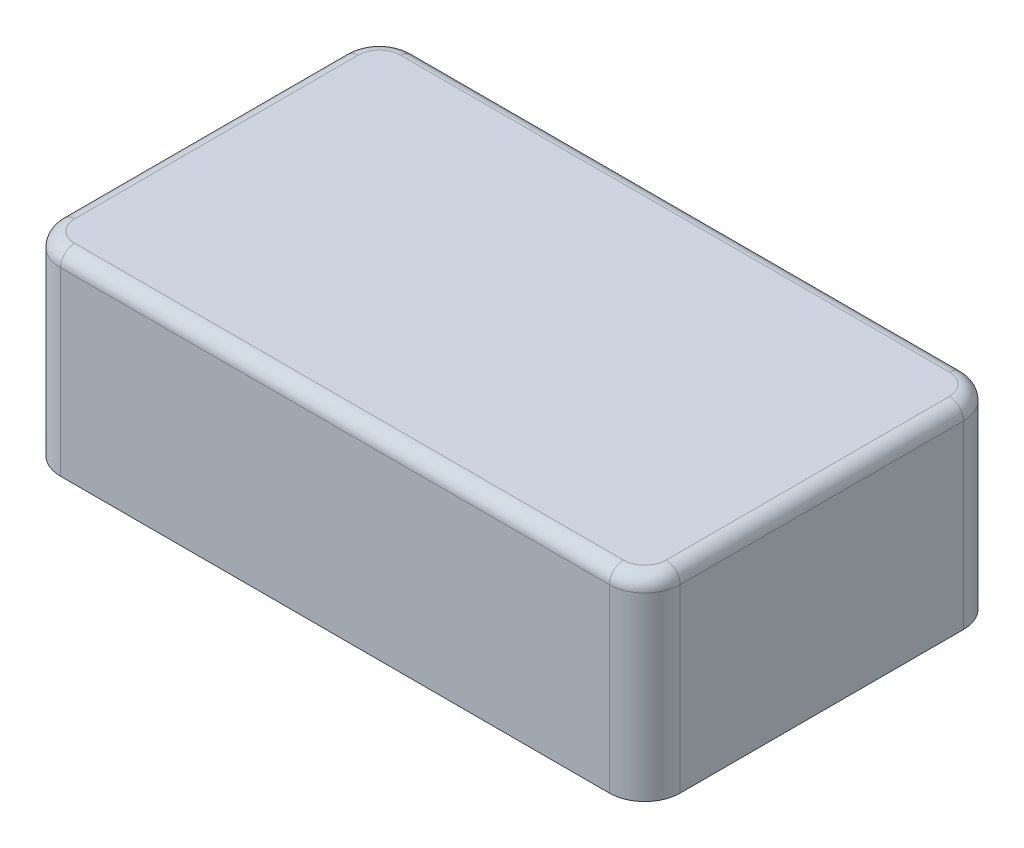
ISO-10303-21;
HEADER;
FILE_DESCRIPTION(('STEP AP214'),'2;1');
FILE_NAME('part.step','',(''),(''),'','','');
FILE_SCHEMA(('AUTOMOTIVE_DESIGN { 1 0 10303 214 1 1 1 1 }'));
ENDSEC;
DATA;
#1=APPLICATION_CONTEXT('core data for automotive mechanical design processes');
#2=APPLICATION_PROTOCOL_DEFINITION('international standard','automotive_design',2000,#1);
#3=PRODUCT_CONTEXT('',#1,'mechanical');
#4=PRODUCT('Part','Part','',(#3));
#5=PRODUCT_RELATED_PRODUCT_CATEGORY('part','',(#4));
#6=PRODUCT_DEFINITION_FORMATION('','',#4);
#7=PRODUCT_DEFINITION_CONTEXT('part definition',#1,'design');
#8=PRODUCT_DEFINITION('design','',#6,#7);
#9=PRODUCT_DEFINITION_SHAPE('','',#8);
#10=(LENGTH_UNIT() NAMED_UNIT(*) SI_UNIT(.MILLI.,.METRE.));
#11=(NAMED_UNIT(*) PLANE_ANGLE_UNIT() SI_UNIT($,.RADIAN.));
#12=(NAMED_UNIT(*) SI_UNIT($,.STERADIAN.) SOLID_ANGLE_UNIT());
#13=UNCERTAINTY_MEASURE_WITH_UNIT(LENGTH_MEASURE(1.E-05),#10,'distance_accuracy_value','');
#14=(GEOMETRIC_REPRESENTATION_CONTEXT(3) GLOBAL_UNCERTAINTY_ASSIGNED_CONTEXT((#13)) GLOBAL_UNIT_ASSIGNED_CONTEXT((#10,
#11,#12)) REPRESENTATION_CONTEXT('',''));
#15=CARTESIAN_POINT('',(0.,0.,0.));
#16=DIRECTION('',(0.,0.,1.));
#17=DIRECTION('',(1.,0.,0.));
#18=AXIS2_PLACEMENT_3D('',#15,#16,#17);
#19=CARTESIAN_POINT('',(1.55,1.1,-0.800000000000001));
#20=DIRECTION('',(0.,-1.,0.));
#21=DIRECTION('',(0.,0.,-1.));
#22=AXIS2_PLACEMENT_3D('',#19,#20,#21);
#23=CYLINDRICAL_SURFACE('',#22,0.2);
#24=DIRECTION('',(0.,-1.,0.));
#25=VECTOR('',#24,1.);
#26=CARTESIAN_POINT('',(1.55,1.1,-1.));
#27=LINE('',#26,#25);
#28=CARTESIAN_POINT('',(1.55,1.02,-1.));
#29=VERTEX_POINT('',#28);
#30=CARTESIAN_POINT('',(1.55,0.,-1.));
#31=VERTEX_POINT('',#30);
#32=EDGE_CURVE('E120',#29,#31,#27,.T.);
#33=ORIENTED_EDGE('',*,*,#32,.F.);
#34=CARTESIAN_POINT('',(1.55,1.02,-0.800000000000001));
#35=DIRECTION('',(0.,1.,0.));
#36=DIRECTION('',(0.,0.,1.));
#37=AXIS2_PLACEMENT_3D('',#34,#35,#36);
#38=CIRCLE('',#37,0.2);
#39=CARTESIAN_POINT('',(1.75,1.02,-0.800000000000001));
#40=VERTEX_POINT('',#39);
#41=EDGE_CURVE('E11',#29,#40,#38,.F.);
#42=ORIENTED_EDGE('',*,*,#41,.T.);
#43=DIRECTION('',(0.,-1.,0.));
#44=VECTOR('',#43,1.);
#45=CARTESIAN_POINT('',(1.75,1.1,-0.800000000000001));
#46=LINE('',#45,#44);
#47=CARTESIAN_POINT('',(1.75,0.,-0.800000000000001));
#48=VERTEX_POINT('',#47);
#49=EDGE_CURVE('E141',#40,#48,#46,.T.);
#50=ORIENTED_EDGE('',*,*,#49,.T.);
#51=CARTESIAN_POINT('',(1.55,0.,-0.800000000000001));
#52=DIRECTION('',(0.,1.,0.));
#53=DIRECTION('',(0.,0.,1.));
#54=AXIS2_PLACEMENT_3D('',#51,#52,#53);
#55=CIRCLE('',#54,0.2);
#56=EDGE_CURVE('E135',#48,#31,#55,.T.);
#57=ORIENTED_EDGE('',*,*,#56,.T.);
#58=EDGE_LOOP('',(#33,#42,#50,#57));
#59=FACE_BOUND('',#58,.T.);
#60=ADVANCED_FACE('F32',(#59),#23,.T.);
#61=CARTESIAN_POINT('',(1.55,1.1,-1.));
#62=DIRECTION('',(0.,0.,1.));
#63=DIRECTION('',(1.,0.,0.));
#64=AXIS2_PLACEMENT_3D('',#61,#62,#63);
#65=PLANE('',#64);
#66=DIRECTION('',(0.,-1.,0.));
#67=VECTOR('',#66,1.);
#68=CARTESIAN_POINT('',(-1.55,1.1,-1.));
#69=LINE('',#68,#67);
#70=CARTESIAN_POINT('',(-1.55,1.02,-1.));
#71=VERTEX_POINT('',#70);
#72=CARTESIAN_POINT('',(-1.55,0.,-1.));
#73=VERTEX_POINT('',#72);
#74=EDGE_CURVE('E129',#71,#73,#69,.T.);
#75=ORIENTED_EDGE('',*,*,#74,.F.);
#76=DIRECTION('',(-1.,0.,0.));
#77=VECTOR('',#76,1.);
#78=CARTESIAN_POINT('',(1.55,1.02,-1.));
#79=LINE('',#78,#77);
#80=EDGE_CURVE('E41',#71,#29,#79,.F.);
#81=ORIENTED_EDGE('',*,*,#80,.T.);
#82=ORIENTED_EDGE('',*,*,#32,.T.);
#83=DIRECTION('',(-1.,0.,0.));
#84=VECTOR('',#83,1.);
#85=CARTESIAN_POINT('',(1.55,0.,-1.));
#86=LINE('',#85,#84);
#87=EDGE_CURVE('E123',#31,#73,#86,.T.);
#88=ORIENTED_EDGE('',*,*,#87,.T.);
#89=EDGE_LOOP('',(#75,#81,#82,#88));
#90=FACE_BOUND('',#89,.T.);
#91=ADVANCED_FACE('F122',(#90),#65,.F.);
#92=CARTESIAN_POINT('',(-1.55,1.1,-0.8));
#93=DIRECTION('',(0.,-1.,0.));
#94=DIRECTION('',(0.,0.,-1.));
#95=AXIS2_PLACEMENT_3D('',#92,#93,#94);
#96=CYLINDRICAL_SURFACE('',#95,0.2);
#97=DIRECTION('',(0.,-1.,0.));
#98=VECTOR('',#97,1.);
#99=CARTESIAN_POINT('',(-1.75,1.1,-0.8));
#100=LINE('',#99,#98);
#101=CARTESIAN_POINT('',(-1.75,1.02,-0.8));
#102=VERTEX_POINT('',#101);
#103=CARTESIAN_POINT('',(-1.75,0.,-0.8));
#104=VERTEX_POINT('',#103);
#105=EDGE_CURVE('E171',#102,#104,#100,.T.);
#106=ORIENTED_EDGE('',*,*,#105,.F.);
#107=CARTESIAN_POINT('',(-1.55,1.02,-0.8));
#108=DIRECTION('',(0.,1.,0.));
#109=DIRECTION('',(0.,0.,1.));
#110=AXIS2_PLACEMENT_3D('',#107,#108,#109);
#111=CIRCLE('',#110,0.2);
#112=EDGE_CURVE('E56',#102,#71,#111,.F.);
#113=ORIENTED_EDGE('',*,*,#112,.T.);
#114=ORIENTED_EDGE('',*,*,#74,.T.);
#115=CARTESIAN_POINT('',(-1.55,0.,-0.8));
#116=DIRECTION('',(0.,1.,0.));
#117=DIRECTION('',(0.,0.,1.));
#118=AXIS2_PLACEMENT_3D('',#115,#116,#117);
#119=CIRCLE('',#118,0.2);
#120=EDGE_CURVE('E138',#73,#104,#119,.T.);
#121=ORIENTED_EDGE('',*,*,#120,.T.);
#122=EDGE_LOOP('',(#106,#113,#114,#121));
#123=FACE_BOUND('',#122,.T.);
#124=ADVANCED_FACE('F274',(#123),#96,.T.);
#125=CARTESIAN_POINT('',(-1.75,1.1,0.8));
#126=DIRECTION('',(1.,0.,0.));
#127=DIRECTION('',(0.,0.,-1.));
#128=AXIS2_PLACEMENT_3D('',#125,#126,#127);
#129=PLANE('',#128);
#130=DIRECTION('',(0.,-1.,0.));
#131=VECTOR('',#130,1.);
#132=CARTESIAN_POINT('',(-1.75,1.1,0.8));
#133=LINE('',#132,#131);
#134=CARTESIAN_POINT('',(-1.75,1.02,0.8));
#135=VERTEX_POINT('',#134);
#136=CARTESIAN_POINT('',(-1.75,0.,0.8));
#137=VERTEX_POINT('',#136);
#138=EDGE_CURVE('E169',#135,#137,#133,.T.);
#139=ORIENTED_EDGE('',*,*,#138,.F.);
#140=DIRECTION('',(0.,0.,1.));
#141=VECTOR('',#140,1.);
#142=CARTESIAN_POINT('',(-1.75,1.02,-0.8));
#143=LINE('',#142,#141);
#144=EDGE_CURVE('E199',#135,#102,#143,.F.);
#145=ORIENTED_EDGE('',*,*,#144,.T.);
#146=ORIENTED_EDGE('',*,*,#105,.T.);
#147=DIRECTION('',(0.,0.,1.));
#148=VECTOR('',#147,1.);
#149=CARTESIAN_POINT('',(-1.75,0.,0.8));
#150=LINE('',#149,#148);
#151=EDGE_CURVE('E148',#104,#137,#150,.T.);
#152=ORIENTED_EDGE('',*,*,#151,.T.);
#153=EDGE_LOOP('',(#139,#145,#146,#152));
#154=FACE_BOUND('',#153,.T.);
#155=ADVANCED_FACE('F272',(#154),#129,.F.);
#156=CARTESIAN_POINT('',(-1.55,1.1,0.8));
#157=DIRECTION('',(0.,-1.,0.));
#158=DIRECTION('',(0.,0.,-1.));
#159=AXIS2_PLACEMENT_3D('',#156,#157,#158);
#160=CYLINDRICAL_SURFACE('',#159,0.2);
#161=DIRECTION('',(0.,-1.,0.));
#162=VECTOR('',#161,1.);
#163=CARTESIAN_POINT('',(-1.55,1.1,1.));
#164=LINE('',#163,#162);
#165=CARTESIAN_POINT('',(-1.55,1.02,1.));
#166=VERTEX_POINT('',#165);
#167=CARTESIAN_POINT('',(-1.55,0.,1.));
#168=VERTEX_POINT('',#167);
#169=EDGE_CURVE('E167',#166,#168,#164,.T.);
#170=ORIENTED_EDGE('',*,*,#169,.F.);
#171=CARTESIAN_POINT('',(-1.55,1.02,0.8));
#172=DIRECTION('',(0.,1.,0.));
#173=DIRECTION('',(0.,0.,1.));
#174=AXIS2_PLACEMENT_3D('',#171,#172,#173);
#175=CIRCLE('',#174,0.2);
#176=EDGE_CURVE('E197',#166,#135,#175,.F.);
#177=ORIENTED_EDGE('',*,*,#176,.T.);
#178=ORIENTED_EDGE('',*,*,#138,.T.);
#179=CARTESIAN_POINT('',(-1.55,0.,0.8));
#180=DIRECTION('',(0.,1.,0.));
#181=DIRECTION('',(0.,0.,-1.));
#182=AXIS2_PLACEMENT_3D('',#179,#180,#181);
#183=CIRCLE('',#182,0.2);
#184=EDGE_CURVE('E151',#137,#168,#183,.T.);
#185=ORIENTED_EDGE('',*,*,#184,.T.);
#186=EDGE_LOOP('',(#170,#177,#178,#185));
#187=FACE_BOUND('',#186,.T.);
#188=ADVANCED_FACE('F270',(#187),#160,.T.);
#189=CARTESIAN_POINT('',(1.55,1.1,1.));
#190=DIRECTION('',(0.,0.,-1.));
#191=DIRECTION('',(-1.,0.,0.));
#192=AXIS2_PLACEMENT_3D('',#189,#190,#191);
#193=PLANE('',#192);
#194=DIRECTION('',(0.,-1.,0.));
#195=VECTOR('',#194,1.);
#196=CARTESIAN_POINT('',(1.55,1.1,1.));
#197=LINE('',#196,#195);
#198=CARTESIAN_POINT('',(1.55,1.02,1.));
#199=VERTEX_POINT('',#198);
#200=CARTESIAN_POINT('',(1.55,0.,1.));
#201=VERTEX_POINT('',#200);
#202=EDGE_CURVE('E165',#199,#201,#197,.T.);
#203=ORIENTED_EDGE('',*,*,#202,.F.);
#204=DIRECTION('',(1.,0.,0.));
#205=VECTOR('',#204,1.);
#206=CARTESIAN_POINT('',(-1.55,1.02,1.));
#207=LINE('',#206,#205);
#208=EDGE_CURVE('E195',#199,#166,#207,.F.);
#209=ORIENTED_EDGE('',*,*,#208,.T.);
#210=ORIENTED_EDGE('',*,*,#169,.T.);
#211=DIRECTION('',(1.,0.,0.));
#212=VECTOR('',#211,1.);
#213=CARTESIAN_POINT('',(1.55,0.,1.));
#214=LINE('',#213,#212);
#215=EDGE_CURVE('E154',#168,#201,#214,.T.);
#216=ORIENTED_EDGE('',*,*,#215,.T.);
#217=EDGE_LOOP('',(#203,#209,#210,#216));
#218=FACE_BOUND('',#217,.T.);
#219=ADVANCED_FACE('F258',(#218),#193,.F.);
#220=CARTESIAN_POINT('',(1.55,1.1,0.799999999999999));
#221=DIRECTION('',(0.,-1.,0.));
#222=DIRECTION('',(0.,0.,-1.));
#223=AXIS2_PLACEMENT_3D('',#220,#221,#222);
#224=CYLINDRICAL_SURFACE('',#223,0.2);
#225=DIRECTION('',(0.,-1.,0.));
#226=VECTOR('',#225,1.);
#227=CARTESIAN_POINT('',(1.75,1.1,0.799999999999999));
#228=LINE('',#227,#226);
#229=CARTESIAN_POINT('',(1.75,1.02,0.799999999999999));
#230=VERTEX_POINT('',#229);
#231=CARTESIAN_POINT('',(1.75,0.,0.799999999999999));
#232=VERTEX_POINT('',#231);
#233=EDGE_CURVE('E163',#230,#232,#228,.T.);
#234=ORIENTED_EDGE('',*,*,#233,.F.);
#235=CARTESIAN_POINT('',(1.55,1.02,0.799999999999999));
#236=DIRECTION('',(0.,1.,0.));
#237=DIRECTION('',(0.,0.,1.));
#238=AXIS2_PLACEMENT_3D('',#235,#236,#237);
#239=CIRCLE('',#238,0.2);
#240=EDGE_CURVE('E193',#230,#199,#239,.F.);
#241=ORIENTED_EDGE('',*,*,#240,.T.);
#242=ORIENTED_EDGE('',*,*,#202,.T.);
#243=CARTESIAN_POINT('',(1.55,0.,0.799999999999999));
#244=DIRECTION('',(0.,1.,0.));
#245=DIRECTION('',(0.,0.,1.));
#246=AXIS2_PLACEMENT_3D('',#243,#244,#245);
#247=CIRCLE('',#246,0.2);
#248=EDGE_CURVE('E157',#201,#232,#247,.T.);
#249=ORIENTED_EDGE('',*,*,#248,.T.);
#250=EDGE_LOOP('',(#234,#241,#242,#249));
#251=FACE_BOUND('',#250,.T.);
#252=ADVANCED_FACE('F255',(#251),#224,.T.);
#253=CARTESIAN_POINT('',(1.75,1.1,0.799999999999999));
#254=DIRECTION('',(-1.,0.,0.));
#255=DIRECTION('',(0.,0.,1.));
#256=AXIS2_PLACEMENT_3D('',#253,#254,#255);
#257=PLANE('',#256);
#258=ORIENTED_EDGE('',*,*,#49,.F.);
#259=DIRECTION('',(0.,0.,-1.));
#260=VECTOR('',#259,1.);
#261=CARTESIAN_POINT('',(1.75,1.02,0.799999999999999));
#262=LINE('',#261,#260);
#263=EDGE_CURVE('E190',#40,#230,#262,.F.);
#264=ORIENTED_EDGE('',*,*,#263,.T.);
#265=ORIENTED_EDGE('',*,*,#233,.T.);
#266=DIRECTION('',(0.,0.,-1.));
#267=VECTOR('',#266,1.);
#268=CARTESIAN_POINT('',(1.75,0.,0.799999999999999));
#269=LINE('',#268,#267);
#270=EDGE_CURVE('E160',#232,#48,#269,.T.);
#271=ORIENTED_EDGE('',*,*,#270,.T.);
#272=EDGE_LOOP('',(#258,#264,#265,#271));
#273=FACE_BOUND('',#272,.T.);
#274=ADVANCED_FACE('F242',(#273),#257,.F.);
#275=CARTESIAN_POINT('',(1.55,1.1,-0.800000000000001));
#276=DIRECTION('',(0.,1.,0.));
#277=DIRECTION('',(0.,0.,1.));
#278=AXIS2_PLACEMENT_3D('',#275,#276,#277);
#279=PLANE('',#278);
#280=CARTESIAN_POINT('',(1.55,1.1,0.799999999999999));
#281=DIRECTION('',(0.,1.,0.));
#282=DIRECTION('',(0.,0.,1.));
#283=AXIS2_PLACEMENT_3D('',#280,#281,#282);
#284=CIRCLE('',#283,0.12);
#285=CARTESIAN_POINT('',(1.55,1.1,0.92));
#286=VERTEX_POINT('',#285);
#287=CARTESIAN_POINT('',(1.67,1.1,0.799999999999999));
#288=VERTEX_POINT('',#287);
#289=EDGE_CURVE('E185',#286,#288,#284,.T.);
#290=ORIENTED_EDGE('',*,*,#289,.T.);
#291=DIRECTION('',(0.,0.,-1.));
#292=VECTOR('',#291,1.);
#293=CARTESIAN_POINT('',(1.67,1.1,-0.800000000000001));
#294=LINE('',#293,#292);
#295=CARTESIAN_POINT('',(1.67,1.1,-0.800000000000001));
#296=VERTEX_POINT('',#295);
#297=EDGE_CURVE('E187',#288,#296,#294,.T.);
#298=ORIENTED_EDGE('',*,*,#297,.T.);
#299=CARTESIAN_POINT('',(1.55,1.1,-0.800000000000001));
#300=DIRECTION('',(0.,1.,0.));
#301=DIRECTION('',(0.,0.,1.));
#302=AXIS2_PLACEMENT_3D('',#299,#300,#301);
#303=CIRCLE('',#302,0.12);
#304=CARTESIAN_POINT('',(1.55,1.1,-0.92));
#305=VERTEX_POINT('',#304);
#306=EDGE_CURVE('E128',#296,#305,#303,.T.);
#307=ORIENTED_EDGE('',*,*,#306,.T.);
#308=DIRECTION('',(-1.,0.,0.));
#309=VECTOR('',#308,1.);
#310=CARTESIAN_POINT('',(-1.55,1.1,-0.92));
#311=LINE('',#310,#309);
#312=CARTESIAN_POINT('',(-1.55,1.1,-0.92));
#313=VERTEX_POINT('',#312);
#314=EDGE_CURVE('E175',#305,#313,#311,.T.);
#315=ORIENTED_EDGE('',*,*,#314,.T.);
#316=CARTESIAN_POINT('',(-1.55,1.1,-0.8));
#317=DIRECTION('',(0.,1.,0.));
#318=DIRECTION('',(0.,0.,1.));
#319=AXIS2_PLACEMENT_3D('',#316,#317,#318);
#320=CIRCLE('',#319,0.12);
#321=CARTESIAN_POINT('',(-1.67,1.1,-0.8));
#322=VERTEX_POINT('',#321);
#323=EDGE_CURVE('E177',#313,#322,#320,.T.);
#324=ORIENTED_EDGE('',*,*,#323,.T.);
#325=DIRECTION('',(0.,0.,1.));
#326=VECTOR('',#325,1.);
#327=CARTESIAN_POINT('',(-1.67,1.1,0.8));
#328=LINE('',#327,#326);
#329=CARTESIAN_POINT('',(-1.67,1.1,0.8));
#330=VERTEX_POINT('',#329);
#331=EDGE_CURVE('E179',#322,#330,#328,.T.);
#332=ORIENTED_EDGE('',*,*,#331,.T.);
#333=CARTESIAN_POINT('',(-1.55,1.1,0.8));
#334=DIRECTION('',(0.,1.,0.));
#335=DIRECTION('',(0.,0.,1.));
#336=AXIS2_PLACEMENT_3D('',#333,#334,#335);
#337=CIRCLE('',#336,0.12);
#338=CARTESIAN_POINT('',(-1.55,1.1,0.92));
#339=VERTEX_POINT('',#338);
#340=EDGE_CURVE('E181',#330,#339,#337,.T.);
#341=ORIENTED_EDGE('',*,*,#340,.T.);
#342=DIRECTION('',(1.,0.,0.));
#343=VECTOR('',#342,1.);
#344=CARTESIAN_POINT('',(1.55,1.1,0.92));
#345=LINE('',#344,#343);
#346=EDGE_CURVE('E183',#339,#286,#345,.T.);
#347=ORIENTED_EDGE('',*,*,#346,.T.);
#348=EDGE_LOOP('',(#290,#298,#307,#315,#324,#332,#341,#347));
#349=FACE_BOUND('',#348,.T.);
#350=ADVANCED_FACE('F230',(#349),#279,.T.);
#351=CARTESIAN_POINT('',(1.55,0.,-0.800000000000001));
#352=DIRECTION('',(0.,1.,0.));
#353=DIRECTION('',(0.,0.,1.));
#354=AXIS2_PLACEMENT_3D('',#351,#352,#353);
#355=PLANE('',#354);
#356=ORIENTED_EDGE('',*,*,#56,.F.);
#357=ORIENTED_EDGE('',*,*,#270,.F.);
#358=ORIENTED_EDGE('',*,*,#248,.F.);
#359=ORIENTED_EDGE('',*,*,#215,.F.);
#360=ORIENTED_EDGE('',*,*,#184,.F.);
#361=ORIENTED_EDGE('',*,*,#151,.F.);
#362=ORIENTED_EDGE('',*,*,#120,.F.);
#363=ORIENTED_EDGE('',*,*,#87,.F.);
#364=EDGE_LOOP('',(#356,#357,#358,#359,#360,#361,#362,#363));
#365=FACE_BOUND('',#364,.T.);
#366=ADVANCED_FACE('F133',(#365),#355,.F.);
#367=CARTESIAN_POINT('',(-1.67,1.02,-0.800000000000001));
#368=DIRECTION('',(0.,0.,-1.));
#369=DIRECTION('',(-1.,0.,0.));
#370=AXIS2_PLACEMENT_3D('',#367,#368,#369);
#371=CYLINDRICAL_SURFACE('',#370,0.08);
#372=CARTESIAN_POINT('',(-1.67,1.02,-0.8));
#373=DIRECTION('',(0.,0.,-1.));
#374=DIRECTION('',(-1.,0.,0.));
#375=AXIS2_PLACEMENT_3D('',#372,#373,#374);
#376=CIRCLE('',#375,0.08);
#377=EDGE_CURVE('E145',#102,#322,#376,.T.);
#378=ORIENTED_EDGE('',*,*,#377,.F.);
#379=ORIENTED_EDGE('',*,*,#144,.F.);
#380=CARTESIAN_POINT('',(-1.67,1.02,0.8));
#381=DIRECTION('',(0.,0.,1.));
#382=DIRECTION('',(1.,0.,0.));
#383=AXIS2_PLACEMENT_3D('',#380,#381,#382);
#384=CIRCLE('',#383,0.08);
#385=EDGE_CURVE('E36',#330,#135,#384,.T.);
#386=ORIENTED_EDGE('',*,*,#385,.F.);
#387=ORIENTED_EDGE('',*,*,#331,.F.);
#388=EDGE_LOOP('',(#378,#379,#386,#387));
#389=FACE_BOUND('',#388,.T.);
#390=ADVANCED_FACE('F34',(#389),#371,.T.);
#391=CARTESIAN_POINT('',(-1.55,1.02,0.8));
#392=DIRECTION('',(0.,1.,0.));
#393=DIRECTION('',(0.,0.,1.));
#394=AXIS2_PLACEMENT_3D('',#391,#392,#393);
#395=TOROIDAL_SURFACE('',#394,0.12,0.08);
#396=ORIENTED_EDGE('',*,*,#385,.T.);
#397=ORIENTED_EDGE('',*,*,#176,.F.);
#398=CARTESIAN_POINT('',(-1.55,1.02,0.92));
#399=DIRECTION('',(1.,0.,0.));
#400=DIRECTION('',(0.,0.,-1.));
#401=AXIS2_PLACEMENT_3D('',#398,#399,#400);
#402=CIRCLE('',#401,0.08);
#403=EDGE_CURVE('E216',#339,#166,#402,.T.);
#404=ORIENTED_EDGE('',*,*,#403,.F.);
#405=ORIENTED_EDGE('',*,*,#340,.F.);
#406=EDGE_LOOP('',(#396,#397,#404,#405));
#407=FACE_BOUND('',#406,.T.);
#408=ADVANCED_FACE('F267',(#407),#395,.T.);
#409=CARTESIAN_POINT('',(-1.55,1.02,-0.8));
#410=DIRECTION('',(0.,1.,0.));
#411=DIRECTION('',(0.,0.,1.));
#412=AXIS2_PLACEMENT_3D('',#409,#410,#411);
#413=TOROIDAL_SURFACE('',#412,0.12,0.08);
#414=ORIENTED_EDGE('',*,*,#377,.T.);
#415=ORIENTED_EDGE('',*,*,#323,.F.);
#416=CARTESIAN_POINT('',(-1.55,1.02,-0.92));
#417=DIRECTION('',(1.,0.,0.));
#418=DIRECTION('',(0.,0.,-1.));
#419=AXIS2_PLACEMENT_3D('',#416,#417,#418);
#420=CIRCLE('',#419,0.08);
#421=EDGE_CURVE('E213',#71,#313,#420,.T.);
#422=ORIENTED_EDGE('',*,*,#421,.F.);
#423=ORIENTED_EDGE('',*,*,#112,.F.);
#424=EDGE_LOOP('',(#414,#415,#422,#423));
#425=FACE_BOUND('',#424,.T.);
#426=ADVANCED_FACE('F222',(#425),#413,.T.);
#427=CARTESIAN_POINT('',(1.55,1.02,0.92));
#428=DIRECTION('',(-1.,0.,0.));
#429=DIRECTION('',(0.,0.,1.));
#430=AXIS2_PLACEMENT_3D('',#427,#428,#429);
#431=CYLINDRICAL_SURFACE('',#430,0.08);
#432=ORIENTED_EDGE('',*,*,#403,.T.);
#433=ORIENTED_EDGE('',*,*,#208,.F.);
#434=CARTESIAN_POINT('',(1.55,1.02,0.92));
#435=DIRECTION('',(1.,0.,0.));
#436=DIRECTION('',(0.,0.,-1.));
#437=AXIS2_PLACEMENT_3D('',#434,#435,#436);
#438=CIRCLE('',#437,0.08);
#439=EDGE_CURVE('E210',#286,#199,#438,.T.);
#440=ORIENTED_EDGE('',*,*,#439,.F.);
#441=ORIENTED_EDGE('',*,*,#346,.F.);
#442=EDGE_LOOP('',(#432,#433,#440,#441));
#443=FACE_BOUND('',#442,.T.);
#444=ADVANCED_FACE('F263',(#443),#431,.T.);
#445=CARTESIAN_POINT('',(1.55,1.02,-0.92));
#446=DIRECTION('',(1.,0.,0.));
#447=DIRECTION('',(0.,0.,-1.));
#448=AXIS2_PLACEMENT_3D('',#445,#446,#447);
#449=CYLINDRICAL_SURFACE('',#448,0.08);
#450=ORIENTED_EDGE('',*,*,#421,.T.);
#451=ORIENTED_EDGE('',*,*,#314,.F.);
#452=CARTESIAN_POINT('',(1.55,1.02,-0.92));
#453=DIRECTION('',(1.,0.,0.));
#454=DIRECTION('',(0.,0.,-1.));
#455=AXIS2_PLACEMENT_3D('',#452,#453,#454);
#456=CIRCLE('',#455,0.08);
#457=EDGE_CURVE('E207',#29,#305,#456,.T.);
#458=ORIENTED_EDGE('',*,*,#457,.F.);
#459=ORIENTED_EDGE('',*,*,#80,.F.);
#460=EDGE_LOOP('',(#450,#451,#458,#459));
#461=FACE_BOUND('',#460,.T.);
#462=ADVANCED_FACE('F235',(#461),#449,.T.);
#463=CARTESIAN_POINT('',(1.55,1.02,0.799999999999999));
#464=DIRECTION('',(0.,1.,0.));
#465=DIRECTION('',(0.,0.,1.));
#466=AXIS2_PLACEMENT_3D('',#463,#464,#465);
#467=TOROIDAL_SURFACE('',#466,0.12,0.08);
#468=ORIENTED_EDGE('',*,*,#439,.T.);
#469=ORIENTED_EDGE('',*,*,#240,.F.);
#470=CARTESIAN_POINT('',(1.67,1.02,0.799999999999999));
#471=DIRECTION('',(0.,0.,-1.));
#472=DIRECTION('',(-1.,0.,0.));
#473=AXIS2_PLACEMENT_3D('',#470,#471,#472);
#474=CIRCLE('',#473,0.08);
#475=EDGE_CURVE('E205',#288,#230,#474,.T.);
#476=ORIENTED_EDGE('',*,*,#475,.F.);
#477=ORIENTED_EDGE('',*,*,#289,.F.);
#478=EDGE_LOOP('',(#468,#469,#476,#477));
#479=FACE_BOUND('',#478,.T.);
#480=ADVANCED_FACE('F251',(#479),#467,.T.);
#481=CARTESIAN_POINT('',(1.55,1.02,-0.800000000000001));
#482=DIRECTION('',(0.,1.,0.));
#483=DIRECTION('',(0.,0.,1.));
#484=AXIS2_PLACEMENT_3D('',#481,#482,#483);
#485=TOROIDAL_SURFACE('',#484,0.12,0.08);
#486=ORIENTED_EDGE('',*,*,#457,.T.);
#487=ORIENTED_EDGE('',*,*,#306,.F.);
#488=CARTESIAN_POINT('',(1.67,1.02,-0.800000000000001));
#489=DIRECTION('',(0.,0.,1.));
#490=DIRECTION('',(1.,0.,0.));
#491=AXIS2_PLACEMENT_3D('',#488,#489,#490);
#492=CIRCLE('',#491,0.08);
#493=EDGE_CURVE('E203',#40,#296,#492,.T.);
#494=ORIENTED_EDGE('',*,*,#493,.F.);
#495=ORIENTED_EDGE('',*,*,#41,.F.);
#496=EDGE_LOOP('',(#486,#487,#494,#495));
#497=FACE_BOUND('',#496,.T.);
#498=ADVANCED_FACE('F238',(#497),#485,.T.);
#499=CARTESIAN_POINT('',(1.67,1.02,-0.800000000000001));
#500=DIRECTION('',(0.,0.,1.));
#501=DIRECTION('',(1.,0.,0.));
#502=AXIS2_PLACEMENT_3D('',#499,#500,#501);
#503=CYLINDRICAL_SURFACE('',#502,0.08);
#504=ORIENTED_EDGE('',*,*,#475,.T.);
#505=ORIENTED_EDGE('',*,*,#263,.F.);
#506=ORIENTED_EDGE('',*,*,#493,.T.);
#507=ORIENTED_EDGE('',*,*,#297,.F.);
#508=EDGE_LOOP('',(#504,#505,#506,#507));
#509=FACE_BOUND('',#508,.T.);
#510=ADVANCED_FACE('F245',(#509),#503,.T.);
#511=CLOSED_SHELL('',(#60,#91,#124,#155,#188,#219,#252,#274,#350,#366,#390,#408,#426,#444,#462,
#480,#498,#510));
#512=MANIFOLD_SOLID_BREP('B2',#511);
#513=ADVANCED_BREP_SHAPE_REPRESENTATION('',(#18,#512),#14);
#514=SHAPE_DEFINITION_REPRESENTATION(#9,#513);
ENDSEC;
END-ISO-10303-21;
